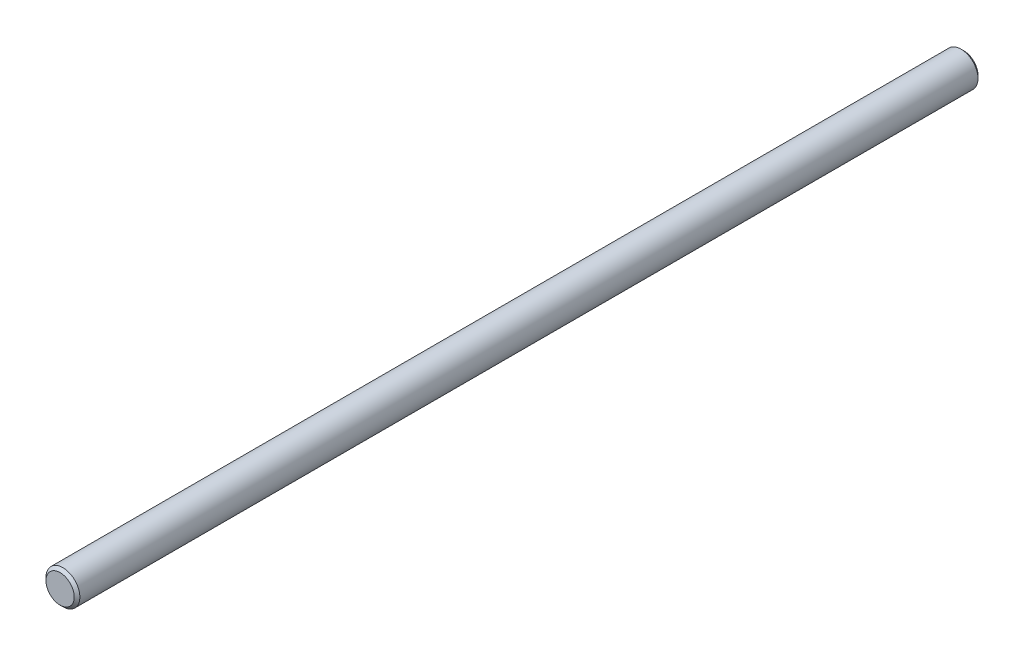
ISO-10303-21;
HEADER;
FILE_DESCRIPTION(('STEP AP214'),'2;1');
FILE_NAME('part.step','',(''),(''),'','','');
FILE_SCHEMA(('AUTOMOTIVE_DESIGN { 1 0 10303 214 1 1 1 1 }'));
ENDSEC;
DATA;
#1=APPLICATION_CONTEXT('core data for automotive mechanical design processes');
#2=APPLICATION_PROTOCOL_DEFINITION('international standard','automotive_design',2000,#1);
#3=PRODUCT_CONTEXT('',#1,'mechanical');
#4=PRODUCT('Part','Part','',(#3));
#5=PRODUCT_RELATED_PRODUCT_CATEGORY('part','',(#4));
#6=PRODUCT_DEFINITION_FORMATION('','',#4);
#7=PRODUCT_DEFINITION_CONTEXT('part definition',#1,'design');
#8=PRODUCT_DEFINITION('design','',#6,#7);
#9=PRODUCT_DEFINITION_SHAPE('','',#8);
#10=(LENGTH_UNIT() NAMED_UNIT(*) SI_UNIT(.MILLI.,.METRE.));
#11=(NAMED_UNIT(*) PLANE_ANGLE_UNIT() SI_UNIT($,.RADIAN.));
#12=(NAMED_UNIT(*) SI_UNIT($,.STERADIAN.) SOLID_ANGLE_UNIT());
#13=UNCERTAINTY_MEASURE_WITH_UNIT(LENGTH_MEASURE(1.E-05),#10,'distance_accuracy_value','');
#14=(GEOMETRIC_REPRESENTATION_CONTEXT(3) GLOBAL_UNCERTAINTY_ASSIGNED_CONTEXT((#13)) GLOBAL_UNIT_ASSIGNED_CONTEXT((#10,
#11,#12)) REPRESENTATION_CONTEXT('',''));
#15=CARTESIAN_POINT('',(0.,0.,0.));
#16=DIRECTION('',(0.,0.,1.));
#17=DIRECTION('',(1.,0.,0.));
#18=AXIS2_PLACEMENT_3D('',#15,#16,#17);
#19=CARTESIAN_POINT('',(0.,3.62077124931057,160.));
#20=DIRECTION('',(0.,0.,-1.));
#21=DIRECTION('',(-1.,0.,0.));
#22=AXIS2_PLACEMENT_3D('',#19,#20,#21);
#23=CYLINDRICAL_SURFACE('',#22,3.);
#24=CARTESIAN_POINT('',(0.,3.62077124931057,0.500000000000056));
#25=DIRECTION('',(0.,0.,1.));
#26=DIRECTION('',(1.,0.,0.));
#27=AXIS2_PLACEMENT_3D('',#24,#25,#26);
#28=CIRCLE('',#27,3.);
#29=CARTESIAN_POINT('',(3.,3.62077124931057,0.500000000000056));
#30=VERTEX_POINT('',#29);
#31=EDGE_CURVE('E44',#30,#30,#28,.T.);
#32=ORIENTED_EDGE('',*,*,#31,.T.);
#33=EDGE_LOOP('',(#32));
#34=FACE_BOUND('',#33,.T.);
#35=CARTESIAN_POINT('',(0.,3.62077124931057,159.5));
#36=DIRECTION('',(0.,0.,1.));
#37=DIRECTION('',(1.,0.,0.));
#38=AXIS2_PLACEMENT_3D('',#35,#36,#37);
#39=CIRCLE('',#38,3.);
#40=CARTESIAN_POINT('',(3.,3.62077124931057,159.5));
#41=VERTEX_POINT('',#40);
#42=EDGE_CURVE('E48',#41,#41,#39,.F.);
#43=ORIENTED_EDGE('',*,*,#42,.T.);
#44=EDGE_LOOP('',(#43));
#45=FACE_BOUND('',#44,.T.);
#46=ADVANCED_FACE('F37',(#34,#45),#23,.T.);
#47=CARTESIAN_POINT('',(0.,3.62077124931057,160.));
#48=DIRECTION('',(0.,0.,1.));
#49=DIRECTION('',(1.,0.,0.));
#50=AXIS2_PLACEMENT_3D('',#47,#48,#49);
#51=PLANE('',#50);
#52=CARTESIAN_POINT('',(0.,3.62077124931057,160.));
#53=DIRECTION('',(0.,0.,1.));
#54=DIRECTION('',(1.,0.,0.));
#55=AXIS2_PLACEMENT_3D('',#52,#53,#54);
#56=CIRCLE('',#55,2.49999999999999);
#57=CARTESIAN_POINT('',(2.49999999999999,3.62077124931057,160.));
#58=VERTEX_POINT('',#57);
#59=EDGE_CURVE('E52',#58,#58,#56,.T.);
#60=ORIENTED_EDGE('',*,*,#59,.T.);
#61=EDGE_LOOP('',(#60));
#62=FACE_BOUND('',#61,.T.);
#63=ADVANCED_FACE('F58',(#62),#51,.T.);
#64=CARTESIAN_POINT('',(0.,3.62077124931057,0.));
#65=DIRECTION('',(0.,0.,1.));
#66=DIRECTION('',(1.,0.,0.));
#67=AXIS2_PLACEMENT_3D('',#64,#65,#66);
#68=PLANE('',#67);
#69=CARTESIAN_POINT('',(0.,3.62077124931057,0.));
#70=DIRECTION('',(0.,0.,1.));
#71=DIRECTION('',(1.,0.,0.));
#72=AXIS2_PLACEMENT_3D('',#69,#70,#71);
#73=CIRCLE('',#72,2.49999999999996);
#74=CARTESIAN_POINT('',(2.49999999999996,3.62077124931057,0.));
#75=VERTEX_POINT('',#74);
#76=EDGE_CURVE('E10',#75,#75,#73,.F.);
#77=ORIENTED_EDGE('',*,*,#76,.T.);
#78=EDGE_LOOP('',(#77));
#79=FACE_BOUND('',#78,.T.);
#80=ADVANCED_FACE('F62',(#79),#68,.F.);
#81=CARTESIAN_POINT('',(0.,3.62077124931057,160.));
#82=DIRECTION('',(0.,0.,-1.));
#83=DIRECTION('',(-1.,0.,0.));
#84=AXIS2_PLACEMENT_3D('',#81,#82,#83);
#85=CONICAL_SURFACE('',#84,2.49999999999999,0.785398163397432);
#86=ORIENTED_EDGE('',*,*,#42,.F.);
#87=EDGE_LOOP('',(#86));
#88=FACE_BOUND('',#87,.T.);
#89=ORIENTED_EDGE('',*,*,#59,.F.);
#90=EDGE_LOOP('',(#89));
#91=FACE_BOUND('',#90,.T.);
#92=ADVANCED_FACE('F60',(#88,#91),#85,.T.);
#93=CARTESIAN_POINT('',(0.,3.62077124931057,0.500000000000056));
#94=DIRECTION('',(0.,0.,1.));
#95=DIRECTION('',(1.,0.,0.));
#96=AXIS2_PLACEMENT_3D('',#93,#94,#95);
#97=CONICAL_SURFACE('',#96,3.,0.785398163397432);
#98=ORIENTED_EDGE('',*,*,#76,.F.);
#99=EDGE_LOOP('',(#98));
#100=FACE_BOUND('',#99,.T.);
#101=ORIENTED_EDGE('',*,*,#31,.F.);
#102=EDGE_LOOP('',(#101));
#103=FACE_BOUND('',#102,.T.);
#104=ADVANCED_FACE('F39',(#100,#103),#97,.T.);
#105=CLOSED_SHELL('',(#46,#63,#80,#92,#104));
#106=MANIFOLD_SOLID_BREP('B2',#105);
#107=ADVANCED_BREP_SHAPE_REPRESENTATION('',(#18,#106),#14);
#108=SHAPE_DEFINITION_REPRESENTATION(#9,#107);
ENDSEC;
END-ISO-10303-21;
